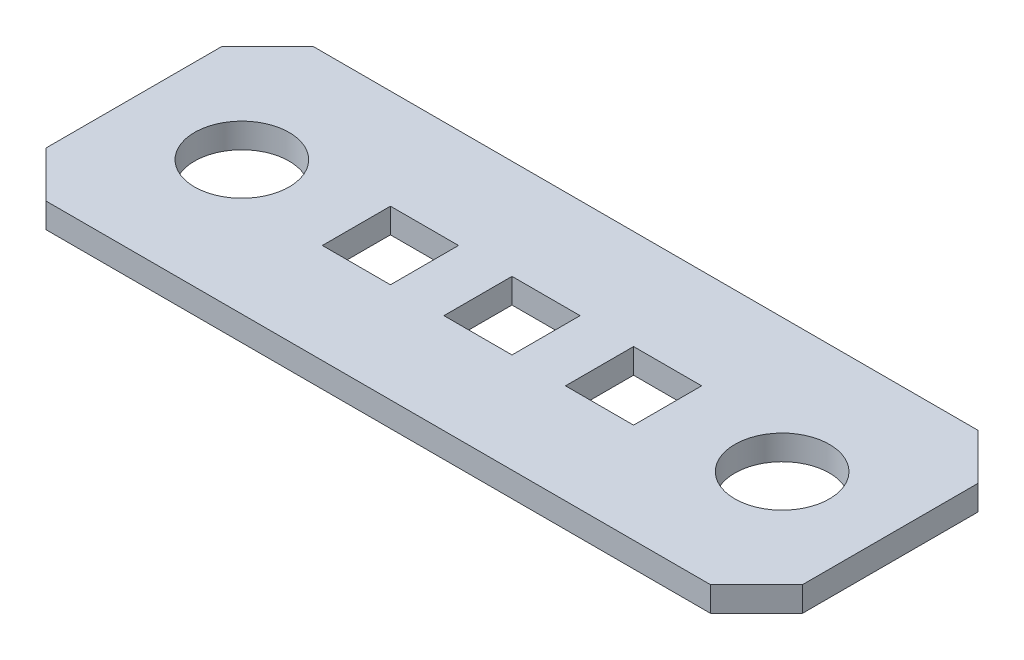
ISO-10303-21;
HEADER;
FILE_DESCRIPTION(('STEP AP214'),'2;1');
FILE_NAME('part.step','',(''),(''),'','','');
FILE_SCHEMA(('AUTOMOTIVE_DESIGN { 1 0 10303 214 1 1 1 1 }'));
ENDSEC;
DATA;
#1=APPLICATION_CONTEXT('core data for automotive mechanical design processes');
#2=APPLICATION_PROTOCOL_DEFINITION('international standard','automotive_design',2000,#1);
#3=PRODUCT_CONTEXT('',#1,'mechanical');
#4=PRODUCT('Part','Part','',(#3));
#5=PRODUCT_RELATED_PRODUCT_CATEGORY('part','',(#4));
#6=PRODUCT_DEFINITION_FORMATION('','',#4);
#7=PRODUCT_DEFINITION_CONTEXT('part definition',#1,'design');
#8=PRODUCT_DEFINITION('design','',#6,#7);
#9=PRODUCT_DEFINITION_SHAPE('','',#8);
#10=(LENGTH_UNIT() NAMED_UNIT(*) SI_UNIT(.MILLI.,.METRE.));
#11=(NAMED_UNIT(*) PLANE_ANGLE_UNIT() SI_UNIT($,.RADIAN.));
#12=(NAMED_UNIT(*) SI_UNIT($,.STERADIAN.) SOLID_ANGLE_UNIT());
#13=UNCERTAINTY_MEASURE_WITH_UNIT(LENGTH_MEASURE(1.E-05),#10,'distance_accuracy_value','');
#14=(GEOMETRIC_REPRESENTATION_CONTEXT(3) GLOBAL_UNCERTAINTY_ASSIGNED_CONTEXT((#13)) GLOBAL_UNIT_ASSIGNED_CONTEXT((#10,
#11,#12)) REPRESENTATION_CONTEXT('',''));
#15=CARTESIAN_POINT('',(0.,0.,0.));
#16=DIRECTION('',(0.,0.,1.));
#17=DIRECTION('',(1.,0.,0.));
#18=AXIS2_PLACEMENT_3D('',#15,#16,#17);
#19=CARTESIAN_POINT('',(0.,0.,0.));
#20=DIRECTION('',(0.,1.,0.));
#21=DIRECTION('',(0.,0.,1.));
#22=AXIS2_PLACEMENT_3D('',#19,#20,#21);
#23=PLANE('',#22);
#24=DIRECTION('',(1.,0.,0.));
#25=VECTOR('',#24,1.);
#26=CARTESIAN_POINT('',(21.8948,0.,-4.6863));
#27=LINE('',#26,#25);
#28=CARTESIAN_POINT('',(21.8948,0.,-4.6863));
#29=VERTEX_POINT('',#28);
#30=CARTESIAN_POINT('',(25.0952,0.,-4.6863));
#31=VERTEX_POINT('',#30);
#32=EDGE_CURVE('E458',#29,#31,#27,.T.);
#33=ORIENTED_EDGE('',*,*,#32,.T.);
#34=DIRECTION('',(0.,0.,-1.));
#35=VECTOR('',#34,1.);
#36=CARTESIAN_POINT('',(25.0952,0.,-7.8867));
#37=LINE('',#36,#35);
#38=CARTESIAN_POINT('',(25.0952,0.,-7.8867));
#39=VERTEX_POINT('',#38);
#40=EDGE_CURVE('E451',#31,#39,#37,.T.);
#41=ORIENTED_EDGE('',*,*,#40,.T.);
#42=DIRECTION('',(-1.,0.,0.));
#43=VECTOR('',#42,1.);
#44=CARTESIAN_POINT('',(21.8948,0.,-7.8867));
#45=LINE('',#44,#43);
#46=CARTESIAN_POINT('',(21.8948,0.,-7.8867));
#47=VERTEX_POINT('',#46);
#48=EDGE_CURVE('E447',#39,#47,#45,.T.);
#49=ORIENTED_EDGE('',*,*,#48,.T.);
#50=DIRECTION('',(0.,0.,1.));
#51=VECTOR('',#50,1.);
#52=CARTESIAN_POINT('',(21.8948,0.,-7.8867));
#53=LINE('',#52,#51);
#54=EDGE_CURVE('E445',#47,#29,#53,.T.);
#55=ORIENTED_EDGE('',*,*,#54,.T.);
#56=EDGE_LOOP('',(#33,#41,#49,#55));
#57=FACE_BOUND('',#56,.T.);
#58=DIRECTION('',(0.707106781186544,0.,0.707106781186551));
#59=VECTOR('',#58,1.);
#60=CARTESIAN_POINT('',(33.401,0.,-12.573));
#61=LINE('',#60,#59);
#62=CARTESIAN_POINT('',(33.401,0.,-12.573));
#63=VERTEX_POINT('',#62);
#64=CARTESIAN_POINT('',(35.56,0.,-10.414));
#65=VERTEX_POINT('',#64);
#66=EDGE_CURVE('E413',#63,#65,#61,.T.);
#67=ORIENTED_EDGE('',*,*,#66,.T.);
#68=DIRECTION('',(0.,0.,1.));
#69=VECTOR('',#68,1.);
#70=CARTESIAN_POINT('',(35.56,0.,-12.573));
#71=LINE('',#70,#69);
#72=CARTESIAN_POINT('',(35.56,0.,-2.15900000000001));
#73=VERTEX_POINT('',#72);
#74=EDGE_CURVE('E411',#65,#73,#71,.T.);
#75=ORIENTED_EDGE('',*,*,#74,.T.);
#76=DIRECTION('',(-0.707106781186548,0.,0.707106781186548));
#77=VECTOR('',#76,1.);
#78=CARTESIAN_POINT('',(35.56,0.,-2.15900000000001));
#79=LINE('',#78,#77);
#80=CARTESIAN_POINT('',(33.401,0.,0.));
#81=VERTEX_POINT('',#80);
#82=EDGE_CURVE('E441',#73,#81,#79,.T.);
#83=ORIENTED_EDGE('',*,*,#82,.T.);
#84=DIRECTION('',(-1.,0.,0.));
#85=VECTOR('',#84,1.);
#86=CARTESIAN_POINT('',(0.,0.,0.));
#87=LINE('',#86,#85);
#88=CARTESIAN_POINT('',(2.15900000000001,0.,0.));
#89=VERTEX_POINT('',#88);
#90=EDGE_CURVE('E435',#81,#89,#87,.T.);
#91=ORIENTED_EDGE('',*,*,#90,.T.);
#92=DIRECTION('',(-0.707106781186548,0.,-0.707106781186548));
#93=VECTOR('',#92,1.);
#94=CARTESIAN_POINT('',(2.15900000000001,0.,0.));
#95=LINE('',#94,#93);
#96=CARTESIAN_POINT('',(0.,0.,-2.15900000000002));
#97=VERTEX_POINT('',#96);
#98=EDGE_CURVE('E429',#89,#97,#95,.T.);
#99=ORIENTED_EDGE('',*,*,#98,.T.);
#100=DIRECTION('',(0.,0.,-1.));
#101=VECTOR('',#100,1.);
#102=CARTESIAN_POINT('',(0.,0.,-12.573));
#103=LINE('',#102,#101);
#104=CARTESIAN_POINT('',(0.,0.,-10.414));
#105=VERTEX_POINT('',#104);
#106=EDGE_CURVE('E425',#97,#105,#103,.T.);
#107=ORIENTED_EDGE('',*,*,#106,.T.);
#108=DIRECTION('',(0.707106781186549,0.,-0.707106781186546));
#109=VECTOR('',#108,1.);
#110=CARTESIAN_POINT('',(0.,0.,-10.414));
#111=LINE('',#110,#109);
#112=CARTESIAN_POINT('',(2.15899999999999,0.,-12.573));
#113=VERTEX_POINT('',#112);
#114=EDGE_CURVE('E421',#105,#113,#111,.T.);
#115=ORIENTED_EDGE('',*,*,#114,.T.);
#116=DIRECTION('',(1.,0.,0.));
#117=VECTOR('',#116,1.);
#118=CARTESIAN_POINT('',(0.,0.,-12.573));
#119=LINE('',#118,#117);
#120=EDGE_CURVE('E417',#113,#63,#119,.T.);
#121=ORIENTED_EDGE('',*,*,#120,.T.);
#122=EDGE_LOOP('',(#67,#75,#83,#91,#99,#107,#115,#121));
#123=FACE_BOUND('',#122,.T.);
#124=DIRECTION('',(0.,0.,1.));
#125=VECTOR('',#124,1.);
#126=CARTESIAN_POINT('',(10.4648,0.,-7.8867));
#127=LINE('',#126,#125);
#128=CARTESIAN_POINT('',(10.4648,0.,-7.8867));
#129=VERTEX_POINT('',#128);
#130=CARTESIAN_POINT('',(10.4648,0.,-4.6863));
#131=VERTEX_POINT('',#130);
#132=EDGE_CURVE('E394',#129,#131,#127,.T.);
#133=ORIENTED_EDGE('',*,*,#132,.T.);
#134=DIRECTION('',(1.,0.,0.));
#135=VECTOR('',#134,1.);
#136=CARTESIAN_POINT('',(10.4648,0.,-4.6863));
#137=LINE('',#136,#135);
#138=CARTESIAN_POINT('',(13.6652,0.,-4.6863));
#139=VERTEX_POINT('',#138);
#140=EDGE_CURVE('E407',#131,#139,#137,.T.);
#141=ORIENTED_EDGE('',*,*,#140,.T.);
#142=DIRECTION('',(0.,0.,-1.));
#143=VECTOR('',#142,1.);
#144=CARTESIAN_POINT('',(13.6652,0.,-7.8867));
#145=LINE('',#144,#143);
#146=CARTESIAN_POINT('',(13.6652,0.,-7.8867));
#147=VERTEX_POINT('',#146);
#148=EDGE_CURVE('E400',#139,#147,#145,.T.);
#149=ORIENTED_EDGE('',*,*,#148,.T.);
#150=DIRECTION('',(-1.,0.,0.));
#151=VECTOR('',#150,1.);
#152=CARTESIAN_POINT('',(10.4648,0.,-7.8867));
#153=LINE('',#152,#151);
#154=EDGE_CURVE('E396',#147,#129,#153,.T.);
#155=ORIENTED_EDGE('',*,*,#154,.T.);
#156=EDGE_LOOP('',(#133,#141,#149,#155));
#157=FACE_BOUND('',#156,.T.);
#158=DIRECTION('',(0.,0.,1.));
#159=VECTOR('',#158,1.);
#160=CARTESIAN_POINT('',(16.1798,0.,-7.8867));
#161=LINE('',#160,#159);
#162=CARTESIAN_POINT('',(16.1798,0.,-7.8867));
#163=VERTEX_POINT('',#162);
#164=CARTESIAN_POINT('',(16.1798,0.,-4.6863));
#165=VERTEX_POINT('',#164);
#166=EDGE_CURVE('E155',#163,#165,#161,.T.);
#167=ORIENTED_EDGE('',*,*,#166,.T.);
#168=DIRECTION('',(1.,0.,0.));
#169=VECTOR('',#168,1.);
#170=CARTESIAN_POINT('',(16.1798,0.,-4.6863));
#171=LINE('',#170,#169);
#172=CARTESIAN_POINT('',(19.3802,0.,-4.6863));
#173=VERTEX_POINT('',#172);
#174=EDGE_CURVE('E388',#165,#173,#171,.T.);
#175=ORIENTED_EDGE('',*,*,#174,.T.);
#176=DIRECTION('',(0.,0.,-1.));
#177=VECTOR('',#176,1.);
#178=CARTESIAN_POINT('',(19.3802,0.,-7.8867));
#179=LINE('',#178,#177);
#180=CARTESIAN_POINT('',(19.3802,0.,-7.8867));
#181=VERTEX_POINT('',#180);
#182=EDGE_CURVE('E150',#173,#181,#179,.T.);
#183=ORIENTED_EDGE('',*,*,#182,.T.);
#184=DIRECTION('',(-1.,0.,0.));
#185=VECTOR('',#184,1.);
#186=CARTESIAN_POINT('',(16.1798,0.,-7.8867));
#187=LINE('',#186,#185);
#188=EDGE_CURVE('E152',#181,#163,#187,.T.);
#189=ORIENTED_EDGE('',*,*,#188,.T.);
#190=EDGE_LOOP('',(#167,#175,#183,#189));
#191=FACE_BOUND('',#190,.T.);
#192=CARTESIAN_POINT('',(5.07999999999998,0.,-6.28650000000001));
#193=DIRECTION('',(0.,1.,0.));
#194=DIRECTION('',(0.,0.,1.));
#195=AXIS2_PLACEMENT_3D('',#192,#193,#194);
#196=CIRCLE('',#195,2.2225);
#197=CARTESIAN_POINT('',(5.07999999999998,0.,-4.06400000000001));
#198=VERTEX_POINT('',#197);
#199=EDGE_CURVE('E168',#198,#198,#196,.T.);
#200=ORIENTED_EDGE('',*,*,#199,.T.);
#201=EDGE_LOOP('',(#200));
#202=FACE_BOUND('',#201,.T.);
#203=CARTESIAN_POINT('',(30.48,0.,-6.28650000000001));
#204=DIRECTION('',(0.,1.,0.));
#205=DIRECTION('',(0.,0.,1.));
#206=AXIS2_PLACEMENT_3D('',#203,#204,#205);
#207=CIRCLE('',#206,2.2225);
#208=CARTESIAN_POINT('',(30.48,0.,-4.06400000000001));
#209=VERTEX_POINT('',#208);
#210=EDGE_CURVE('E18',#209,#209,#207,.T.);
#211=ORIENTED_EDGE('',*,*,#210,.T.);
#212=EDGE_LOOP('',(#211));
#213=FACE_BOUND('',#212,.T.);
#214=ADVANCED_FACE('F15',(#57,#123,#157,#191,#202,#213),#23,.F.);
#215=CARTESIAN_POINT('',(30.48,0.,-6.28650000000001));
#216=DIRECTION('',(0.,1.,0.));
#217=DIRECTION('',(0.,0.,1.));
#218=AXIS2_PLACEMENT_3D('',#215,#216,#217);
#219=CYLINDRICAL_SURFACE('',#218,2.2225);
#220=CARTESIAN_POINT('',(30.48,1.1684,-6.28650000000001));
#221=DIRECTION('',(0.,1.,0.));
#222=DIRECTION('',(0.,0.,1.));
#223=AXIS2_PLACEMENT_3D('',#220,#221,#222);
#224=CIRCLE('',#223,2.2225);
#225=CARTESIAN_POINT('',(30.48,1.1684,-4.06400000000001));
#226=VERTEX_POINT('',#225);
#227=EDGE_CURVE('E183',#226,#226,#224,.F.);
#228=ORIENTED_EDGE('',*,*,#227,.F.);
#229=EDGE_LOOP('',(#228));
#230=FACE_BOUND('',#229,.T.);
#231=ORIENTED_EDGE('',*,*,#210,.F.);
#232=EDGE_LOOP('',(#231));
#233=FACE_BOUND('',#232,.T.);
#234=ADVANCED_FACE('F191',(#230,#233),#219,.F.);
#235=CARTESIAN_POINT('',(5.07999999999998,0.,-6.28650000000001));
#236=DIRECTION('',(0.,1.,0.));
#237=DIRECTION('',(0.,0.,1.));
#238=AXIS2_PLACEMENT_3D('',#235,#236,#237);
#239=CYLINDRICAL_SURFACE('',#238,2.2225);
#240=CARTESIAN_POINT('',(5.07999999999998,1.1684,-6.28650000000001));
#241=DIRECTION('',(0.,1.,0.));
#242=DIRECTION('',(0.,0.,1.));
#243=AXIS2_PLACEMENT_3D('',#240,#241,#242);
#244=CIRCLE('',#243,2.2225);
#245=CARTESIAN_POINT('',(5.07999999999998,1.1684,-4.06400000000001));
#246=VERTEX_POINT('',#245);
#247=EDGE_CURVE('E179',#246,#246,#244,.F.);
#248=ORIENTED_EDGE('',*,*,#247,.F.);
#249=EDGE_LOOP('',(#248));
#250=FACE_BOUND('',#249,.T.);
#251=ORIENTED_EDGE('',*,*,#199,.F.);
#252=EDGE_LOOP('',(#251));
#253=FACE_BOUND('',#252,.T.);
#254=ADVANCED_FACE('F193',(#250,#253),#239,.F.);
#255=CARTESIAN_POINT('',(16.1798,0.,-7.8867));
#256=DIRECTION('',(-1.,0.,0.));
#257=DIRECTION('',(0.,0.,1.));
#258=AXIS2_PLACEMENT_3D('',#255,#256,#257);
#259=PLANE('',#258);
#260=DIRECTION('',(0.,1.,0.));
#261=VECTOR('',#260,1.);
#262=CARTESIAN_POINT('',(16.1798,0.,-4.6863));
#263=LINE('',#262,#261);
#264=CARTESIAN_POINT('',(16.1798,1.1684,-4.6863));
#265=VERTEX_POINT('',#264);
#266=EDGE_CURVE('E166',#265,#165,#263,.F.);
#267=ORIENTED_EDGE('',*,*,#266,.T.);
#268=ORIENTED_EDGE('',*,*,#166,.F.);
#269=DIRECTION('',(0.,1.,0.));
#270=VECTOR('',#269,1.);
#271=CARTESIAN_POINT('',(16.1798,0.,-7.8867));
#272=LINE('',#271,#270);
#273=CARTESIAN_POINT('',(16.1798,1.1684,-7.8867));
#274=VERTEX_POINT('',#273);
#275=EDGE_CURVE('E160',#163,#274,#272,.T.);
#276=ORIENTED_EDGE('',*,*,#275,.T.);
#277=DIRECTION('',(0.,0.,1.));
#278=VECTOR('',#277,1.);
#279=CARTESIAN_POINT('',(16.1798,1.1684,0.));
#280=LINE('',#279,#278);
#281=EDGE_CURVE('E182',#265,#274,#280,.F.);
#282=ORIENTED_EDGE('',*,*,#281,.F.);
#283=EDGE_LOOP('',(#267,#268,#276,#282));
#284=FACE_BOUND('',#283,.T.);
#285=ADVANCED_FACE('F163',(#284),#259,.F.);
#286=CARTESIAN_POINT('',(16.1798,0.,-7.8867));
#287=DIRECTION('',(0.,0.,-1.));
#288=DIRECTION('',(-1.,0.,0.));
#289=AXIS2_PLACEMENT_3D('',#286,#287,#288);
#290=PLANE('',#289);
#291=ORIENTED_EDGE('',*,*,#275,.F.);
#292=ORIENTED_EDGE('',*,*,#188,.F.);
#293=DIRECTION('',(0.,1.,0.));
#294=VECTOR('',#293,1.);
#295=CARTESIAN_POINT('',(19.3802,0.,-7.8867));
#296=LINE('',#295,#294);
#297=CARTESIAN_POINT('',(19.3802,1.1684,-7.8867));
#298=VERTEX_POINT('',#297);
#299=EDGE_CURVE('E175',#181,#298,#296,.T.);
#300=ORIENTED_EDGE('',*,*,#299,.T.);
#301=DIRECTION('',(1.,0.,0.));
#302=VECTOR('',#301,1.);
#303=CARTESIAN_POINT('',(0.,1.1684,-7.8867));
#304=LINE('',#303,#302);
#305=EDGE_CURVE('E172',#274,#298,#304,.T.);
#306=ORIENTED_EDGE('',*,*,#305,.F.);
#307=EDGE_LOOP('',(#291,#292,#300,#306));
#308=FACE_BOUND('',#307,.T.);
#309=ADVANCED_FACE('F170',(#308),#290,.F.);
#310=CARTESIAN_POINT('',(19.3802,0.,-7.8867));
#311=DIRECTION('',(1.,0.,0.));
#312=DIRECTION('',(0.,0.,-1.));
#313=AXIS2_PLACEMENT_3D('',#310,#311,#312);
#314=PLANE('',#313);
#315=ORIENTED_EDGE('',*,*,#299,.F.);
#316=ORIENTED_EDGE('',*,*,#182,.F.);
#317=DIRECTION('',(0.,1.,0.));
#318=VECTOR('',#317,1.);
#319=CARTESIAN_POINT('',(19.3802,0.,-4.6863));
#320=LINE('',#319,#318);
#321=CARTESIAN_POINT('',(19.3802,1.1684,-4.6863));
#322=VERTEX_POINT('',#321);
#323=EDGE_CURVE('E392',#173,#322,#320,.T.);
#324=ORIENTED_EDGE('',*,*,#323,.T.);
#325=DIRECTION('',(0.,0.,1.));
#326=VECTOR('',#325,1.);
#327=CARTESIAN_POINT('',(19.3802,1.1684,0.));
#328=LINE('',#327,#326);
#329=EDGE_CURVE('E387',#298,#322,#328,.T.);
#330=ORIENTED_EDGE('',*,*,#329,.F.);
#331=EDGE_LOOP('',(#315,#316,#324,#330));
#332=FACE_BOUND('',#331,.T.);
#333=ADVANCED_FACE('F279',(#332),#314,.F.);
#334=CARTESIAN_POINT('',(16.1798,0.,-4.6863));
#335=DIRECTION('',(0.,0.,1.));
#336=DIRECTION('',(1.,0.,0.));
#337=AXIS2_PLACEMENT_3D('',#334,#335,#336);
#338=PLANE('',#337);
#339=ORIENTED_EDGE('',*,*,#323,.F.);
#340=ORIENTED_EDGE('',*,*,#174,.F.);
#341=ORIENTED_EDGE('',*,*,#266,.F.);
#342=DIRECTION('',(1.,0.,0.));
#343=VECTOR('',#342,1.);
#344=CARTESIAN_POINT('',(0.,1.1684,-4.6863));
#345=LINE('',#344,#343);
#346=EDGE_CURVE('E464',#322,#265,#345,.F.);
#347=ORIENTED_EDGE('',*,*,#346,.F.);
#348=EDGE_LOOP('',(#339,#340,#341,#347));
#349=FACE_BOUND('',#348,.T.);
#350=ADVANCED_FACE('F275',(#349),#338,.F.);
#351=CARTESIAN_POINT('',(10.4648,0.,-7.8867));
#352=DIRECTION('',(-1.,0.,0.));
#353=DIRECTION('',(0.,0.,1.));
#354=AXIS2_PLACEMENT_3D('',#351,#352,#353);
#355=PLANE('',#354);
#356=DIRECTION('',(0.,1.,0.));
#357=VECTOR('',#356,1.);
#358=CARTESIAN_POINT('',(10.4648,0.,-4.6863));
#359=LINE('',#358,#357);
#360=CARTESIAN_POINT('',(10.4648,1.1684,-4.6863));
#361=VERTEX_POINT('',#360);
#362=EDGE_CURVE('E404',#361,#131,#359,.F.);
#363=ORIENTED_EDGE('',*,*,#362,.T.);
#364=ORIENTED_EDGE('',*,*,#132,.F.);
#365=DIRECTION('',(0.,1.,0.));
#366=VECTOR('',#365,1.);
#367=CARTESIAN_POINT('',(10.4648,0.,-7.8867));
#368=LINE('',#367,#366);
#369=CARTESIAN_POINT('',(10.4648,1.1684,-7.8867));
#370=VERTEX_POINT('',#369);
#371=EDGE_CURVE('E398',#129,#370,#368,.T.);
#372=ORIENTED_EDGE('',*,*,#371,.T.);
#373=DIRECTION('',(0.,0.,1.));
#374=VECTOR('',#373,1.);
#375=CARTESIAN_POINT('',(10.4648,1.1684,0.));
#376=LINE('',#375,#374);
#377=EDGE_CURVE('E467',#361,#370,#376,.F.);
#378=ORIENTED_EDGE('',*,*,#377,.F.);
#379=EDGE_LOOP('',(#363,#364,#372,#378));
#380=FACE_BOUND('',#379,.T.);
#381=ADVANCED_FACE('F271',(#380),#355,.F.);
#382=CARTESIAN_POINT('',(10.4648,0.,-7.8867));
#383=DIRECTION('',(0.,0.,-1.));
#384=DIRECTION('',(-1.,0.,0.));
#385=AXIS2_PLACEMENT_3D('',#382,#383,#384);
#386=PLANE('',#385);
#387=ORIENTED_EDGE('',*,*,#371,.F.);
#388=ORIENTED_EDGE('',*,*,#154,.F.);
#389=DIRECTION('',(0.,1.,0.));
#390=VECTOR('',#389,1.);
#391=CARTESIAN_POINT('',(13.6652,0.,-7.8867));
#392=LINE('',#391,#390);
#393=CARTESIAN_POINT('',(13.6652,1.1684,-7.8867));
#394=VERTEX_POINT('',#393);
#395=EDGE_CURVE('E402',#147,#394,#392,.T.);
#396=ORIENTED_EDGE('',*,*,#395,.T.);
#397=DIRECTION('',(1.,0.,0.));
#398=VECTOR('',#397,1.);
#399=CARTESIAN_POINT('',(0.,1.1684,-7.8867));
#400=LINE('',#399,#398);
#401=EDGE_CURVE('E470',#370,#394,#400,.T.);
#402=ORIENTED_EDGE('',*,*,#401,.F.);
#403=EDGE_LOOP('',(#387,#388,#396,#402));
#404=FACE_BOUND('',#403,.T.);
#405=ADVANCED_FACE('F267',(#404),#386,.F.);
#406=CARTESIAN_POINT('',(13.6652,0.,-7.8867));
#407=DIRECTION('',(1.,0.,0.));
#408=DIRECTION('',(0.,0.,-1.));
#409=AXIS2_PLACEMENT_3D('',#406,#407,#408);
#410=PLANE('',#409);
#411=ORIENTED_EDGE('',*,*,#395,.F.);
#412=ORIENTED_EDGE('',*,*,#148,.F.);
#413=DIRECTION('',(0.,1.,0.));
#414=VECTOR('',#413,1.);
#415=CARTESIAN_POINT('',(13.6652,0.,-4.6863));
#416=LINE('',#415,#414);
#417=CARTESIAN_POINT('',(13.6652,1.1684,-4.6863));
#418=VERTEX_POINT('',#417);
#419=EDGE_CURVE('E409',#139,#418,#416,.T.);
#420=ORIENTED_EDGE('',*,*,#419,.T.);
#421=DIRECTION('',(0.,0.,1.));
#422=VECTOR('',#421,1.);
#423=CARTESIAN_POINT('',(13.6652,1.1684,0.));
#424=LINE('',#423,#422);
#425=EDGE_CURVE('E473',#394,#418,#424,.T.);
#426=ORIENTED_EDGE('',*,*,#425,.F.);
#427=EDGE_LOOP('',(#411,#412,#420,#426));
#428=FACE_BOUND('',#427,.T.);
#429=ADVANCED_FACE('F263',(#428),#410,.F.);
#430=CARTESIAN_POINT('',(10.4648,0.,-4.6863));
#431=DIRECTION('',(0.,0.,1.));
#432=DIRECTION('',(1.,0.,0.));
#433=AXIS2_PLACEMENT_3D('',#430,#431,#432);
#434=PLANE('',#433);
#435=ORIENTED_EDGE('',*,*,#419,.F.);
#436=ORIENTED_EDGE('',*,*,#140,.F.);
#437=ORIENTED_EDGE('',*,*,#362,.F.);
#438=DIRECTION('',(1.,0.,0.));
#439=VECTOR('',#438,1.);
#440=CARTESIAN_POINT('',(0.,1.1684,-4.6863));
#441=LINE('',#440,#439);
#442=EDGE_CURVE('E476',#418,#361,#441,.F.);
#443=ORIENTED_EDGE('',*,*,#442,.F.);
#444=EDGE_LOOP('',(#435,#436,#437,#443));
#445=FACE_BOUND('',#444,.T.);
#446=ADVANCED_FACE('F259',(#445),#434,.F.);
#447=CARTESIAN_POINT('',(35.56,1.1684,-12.573));
#448=DIRECTION('',(-1.,0.,0.));
#449=DIRECTION('',(0.,0.,1.));
#450=AXIS2_PLACEMENT_3D('',#447,#448,#449);
#451=PLANE('',#450);
#452=DIRECTION('',(0.,1.,0.));
#453=VECTOR('',#452,1.);
#454=CARTESIAN_POINT('',(35.56,1.1684,-10.414));
#455=LINE('',#454,#453);
#456=CARTESIAN_POINT('',(35.56,1.1684,-10.414));
#457=VERTEX_POINT('',#456);
#458=EDGE_CURVE('E415',#65,#457,#455,.T.);
#459=ORIENTED_EDGE('',*,*,#458,.T.);
#460=DIRECTION('',(0.,0.,1.));
#461=VECTOR('',#460,1.);
#462=CARTESIAN_POINT('',(35.56,1.1684,0.));
#463=LINE('',#462,#461);
#464=CARTESIAN_POINT('',(35.56,1.1684,-2.15900000000001));
#465=VERTEX_POINT('',#464);
#466=EDGE_CURVE('E479',#465,#457,#463,.F.);
#467=ORIENTED_EDGE('',*,*,#466,.F.);
#468=DIRECTION('',(0.,1.,0.));
#469=VECTOR('',#468,1.);
#470=CARTESIAN_POINT('',(35.56,1.1684,-2.15900000000002));
#471=LINE('',#470,#469);
#472=EDGE_CURVE('E438',#465,#73,#471,.F.);
#473=ORIENTED_EDGE('',*,*,#472,.T.);
#474=ORIENTED_EDGE('',*,*,#74,.F.);
#475=EDGE_LOOP('',(#459,#467,#473,#474));
#476=FACE_BOUND('',#475,.T.);
#477=ADVANCED_FACE('F255',(#476),#451,.F.);
#478=CARTESIAN_POINT('',(33.401,1.1684,-12.573));
#479=DIRECTION('',(-0.707106781186551,0.,0.707106781186544));
#480=DIRECTION('',(0.707106781186544,0.,0.707106781186551));
#481=AXIS2_PLACEMENT_3D('',#478,#479,#480);
#482=PLANE('',#481);
#483=ORIENTED_EDGE('',*,*,#458,.F.);
#484=ORIENTED_EDGE('',*,*,#66,.F.);
#485=DIRECTION('',(0.,1.,0.));
#486=VECTOR('',#485,1.);
#487=CARTESIAN_POINT('',(33.401,1.1684,-12.573));
#488=LINE('',#487,#486);
#489=CARTESIAN_POINT('',(33.401,1.1684,-12.573));
#490=VERTEX_POINT('',#489);
#491=EDGE_CURVE('E419',#63,#490,#488,.T.);
#492=ORIENTED_EDGE('',*,*,#491,.T.);
#493=DIRECTION('',(-0.707106781186544,0.,-0.707106781186551));
#494=VECTOR('',#493,1.);
#495=CARTESIAN_POINT('',(35.56,1.1684,-10.414));
#496=LINE('',#495,#494);
#497=EDGE_CURVE('E482',#457,#490,#496,.T.);
#498=ORIENTED_EDGE('',*,*,#497,.F.);
#499=EDGE_LOOP('',(#483,#484,#492,#498));
#500=FACE_BOUND('',#499,.T.);
#501=ADVANCED_FACE('F251',(#500),#482,.F.);
#502=CARTESIAN_POINT('',(0.,1.1684,-12.573));
#503=DIRECTION('',(0.,0.,1.));
#504=DIRECTION('',(1.,0.,0.));
#505=AXIS2_PLACEMENT_3D('',#502,#503,#504);
#506=PLANE('',#505);
#507=ORIENTED_EDGE('',*,*,#491,.F.);
#508=ORIENTED_EDGE('',*,*,#120,.F.);
#509=DIRECTION('',(0.,1.,0.));
#510=VECTOR('',#509,1.);
#511=CARTESIAN_POINT('',(2.15899999999999,1.1684,-12.573));
#512=LINE('',#511,#510);
#513=CARTESIAN_POINT('',(2.15899999999999,1.1684,-12.573));
#514=VERTEX_POINT('',#513);
#515=EDGE_CURVE('E423',#113,#514,#512,.T.);
#516=ORIENTED_EDGE('',*,*,#515,.T.);
#517=DIRECTION('',(1.,0.,0.));
#518=VECTOR('',#517,1.);
#519=CARTESIAN_POINT('',(0.,1.1684,-12.573));
#520=LINE('',#519,#518);
#521=EDGE_CURVE('E485',#490,#514,#520,.F.);
#522=ORIENTED_EDGE('',*,*,#521,.F.);
#523=EDGE_LOOP('',(#507,#508,#516,#522));
#524=FACE_BOUND('',#523,.T.);
#525=ADVANCED_FACE('F247',(#524),#506,.F.);
#526=CARTESIAN_POINT('',(0.,1.1684,-10.414));
#527=DIRECTION('',(0.707106781186546,0.,0.707106781186549));
#528=DIRECTION('',(0.707106781186549,0.,-0.707106781186546));
#529=AXIS2_PLACEMENT_3D('',#526,#527,#528);
#530=PLANE('',#529);
#531=ORIENTED_EDGE('',*,*,#515,.F.);
#532=ORIENTED_EDGE('',*,*,#114,.F.);
#533=DIRECTION('',(0.,1.,0.));
#534=VECTOR('',#533,1.);
#535=CARTESIAN_POINT('',(0.,1.1684,-10.414));
#536=LINE('',#535,#534);
#537=CARTESIAN_POINT('',(0.,1.1684,-10.414));
#538=VERTEX_POINT('',#537);
#539=EDGE_CURVE('E427',#105,#538,#536,.T.);
#540=ORIENTED_EDGE('',*,*,#539,.T.);
#541=DIRECTION('',(-0.707106781186549,0.,0.707106781186546));
#542=VECTOR('',#541,1.);
#543=CARTESIAN_POINT('',(2.15899999999999,1.1684,-12.573));
#544=LINE('',#543,#542);
#545=EDGE_CURVE('E488',#514,#538,#544,.T.);
#546=ORIENTED_EDGE('',*,*,#545,.F.);
#547=EDGE_LOOP('',(#531,#532,#540,#546));
#548=FACE_BOUND('',#547,.T.);
#549=ADVANCED_FACE('F243',(#548),#530,.F.);
#550=CARTESIAN_POINT('',(0.,1.1684,-12.573));
#551=DIRECTION('',(1.,0.,0.));
#552=DIRECTION('',(0.,0.,-1.));
#553=AXIS2_PLACEMENT_3D('',#550,#551,#552);
#554=PLANE('',#553);
#555=ORIENTED_EDGE('',*,*,#539,.F.);
#556=ORIENTED_EDGE('',*,*,#106,.F.);
#557=DIRECTION('',(0.,1.,0.));
#558=VECTOR('',#557,1.);
#559=CARTESIAN_POINT('',(0.,1.1684,-2.15900000000001));
#560=LINE('',#559,#558);
#561=CARTESIAN_POINT('',(0.,1.1684,-2.15900000000002));
#562=VERTEX_POINT('',#561);
#563=EDGE_CURVE('E431',#97,#562,#560,.T.);
#564=ORIENTED_EDGE('',*,*,#563,.T.);
#565=DIRECTION('',(0.,0.,1.));
#566=VECTOR('',#565,1.);
#567=CARTESIAN_POINT('',(0.,1.1684,0.));
#568=LINE('',#567,#566);
#569=EDGE_CURVE('E491',#538,#562,#568,.T.);
#570=ORIENTED_EDGE('',*,*,#569,.F.);
#571=EDGE_LOOP('',(#555,#556,#564,#570));
#572=FACE_BOUND('',#571,.T.);
#573=ADVANCED_FACE('F239',(#572),#554,.F.);
#574=CARTESIAN_POINT('',(2.15900000000001,1.1684,0.));
#575=DIRECTION('',(0.707106781186548,0.,-0.707106781186548));
#576=DIRECTION('',(-0.707106781186548,0.,-0.707106781186548));
#577=AXIS2_PLACEMENT_3D('',#574,#575,#576);
#578=PLANE('',#577);
#579=ORIENTED_EDGE('',*,*,#563,.F.);
#580=ORIENTED_EDGE('',*,*,#98,.F.);
#581=DIRECTION('',(0.,1.,0.));
#582=VECTOR('',#581,1.);
#583=CARTESIAN_POINT('',(2.15900000000001,1.1684,0.));
#584=LINE('',#583,#582);
#585=CARTESIAN_POINT('',(2.15900000000001,1.1684,0.));
#586=VERTEX_POINT('',#585);
#587=EDGE_CURVE('E433',#89,#586,#584,.T.);
#588=ORIENTED_EDGE('',*,*,#587,.T.);
#589=DIRECTION('',(0.707106781186547,0.,0.707106781186548));
#590=VECTOR('',#589,1.);
#591=CARTESIAN_POINT('',(0.,1.1684,-2.15900000000001));
#592=LINE('',#591,#590);
#593=EDGE_CURVE('E494',#562,#586,#592,.T.);
#594=ORIENTED_EDGE('',*,*,#593,.F.);
#595=EDGE_LOOP('',(#579,#580,#588,#594));
#596=FACE_BOUND('',#595,.T.);
#597=ADVANCED_FACE('F235',(#596),#578,.F.);
#598=CARTESIAN_POINT('',(0.,1.1684,0.));
#599=DIRECTION('',(0.,0.,-1.));
#600=DIRECTION('',(-1.,0.,0.));
#601=AXIS2_PLACEMENT_3D('',#598,#599,#600);
#602=PLANE('',#601);
#603=DIRECTION('',(0.,1.,0.));
#604=VECTOR('',#603,1.);
#605=CARTESIAN_POINT('',(33.401,1.1684,0.));
#606=LINE('',#605,#604);
#607=CARTESIAN_POINT('',(33.4009999999999,1.1684,0.));
#608=VERTEX_POINT('',#607);
#609=EDGE_CURVE('E443',#81,#608,#606,.T.);
#610=ORIENTED_EDGE('',*,*,#609,.T.);
#611=DIRECTION('',(1.,0.,0.));
#612=VECTOR('',#611,1.);
#613=CARTESIAN_POINT('',(0.,1.1684,0.));
#614=LINE('',#613,#612);
#615=EDGE_CURVE('E497',#586,#608,#614,.T.);
#616=ORIENTED_EDGE('',*,*,#615,.F.);
#617=ORIENTED_EDGE('',*,*,#587,.F.);
#618=ORIENTED_EDGE('',*,*,#90,.F.);
#619=EDGE_LOOP('',(#610,#616,#617,#618));
#620=FACE_BOUND('',#619,.T.);
#621=ADVANCED_FACE('F231',(#620),#602,.F.);
#622=CARTESIAN_POINT('',(35.56,1.1684,-2.15900000000001));
#623=DIRECTION('',(-0.707106781186548,0.,-0.707106781186548));
#624=DIRECTION('',(-0.707106781186548,0.,0.707106781186548));
#625=AXIS2_PLACEMENT_3D('',#622,#623,#624);
#626=PLANE('',#625);
#627=ORIENTED_EDGE('',*,*,#609,.F.);
#628=ORIENTED_EDGE('',*,*,#82,.F.);
#629=ORIENTED_EDGE('',*,*,#472,.F.);
#630=DIRECTION('',(0.707106781186548,0.,-0.707106781186547));
#631=VECTOR('',#630,1.);
#632=CARTESIAN_POINT('',(33.4009999999999,1.1684,0.));
#633=LINE('',#632,#631);
#634=EDGE_CURVE('E500',#608,#465,#633,.T.);
#635=ORIENTED_EDGE('',*,*,#634,.F.);
#636=EDGE_LOOP('',(#627,#628,#629,#635));
#637=FACE_BOUND('',#636,.T.);
#638=ADVANCED_FACE('F227',(#637),#626,.F.);
#639=CARTESIAN_POINT('',(21.8948,0.,-7.8867));
#640=DIRECTION('',(-1.,0.,0.));
#641=DIRECTION('',(0.,0.,1.));
#642=AXIS2_PLACEMENT_3D('',#639,#640,#641);
#643=PLANE('',#642);
#644=DIRECTION('',(0.,1.,0.));
#645=VECTOR('',#644,1.);
#646=CARTESIAN_POINT('',(21.8948,0.,-4.6863));
#647=LINE('',#646,#645);
#648=CARTESIAN_POINT('',(21.8948,1.1684,-4.6863));
#649=VERTEX_POINT('',#648);
#650=EDGE_CURVE('E455',#649,#29,#647,.F.);
#651=ORIENTED_EDGE('',*,*,#650,.T.);
#652=ORIENTED_EDGE('',*,*,#54,.F.);
#653=DIRECTION('',(0.,1.,0.));
#654=VECTOR('',#653,1.);
#655=CARTESIAN_POINT('',(21.8948,0.,-7.8867));
#656=LINE('',#655,#654);
#657=CARTESIAN_POINT('',(21.8948,1.1684,-7.8867));
#658=VERTEX_POINT('',#657);
#659=EDGE_CURVE('E449',#47,#658,#656,.T.);
#660=ORIENTED_EDGE('',*,*,#659,.T.);
#661=DIRECTION('',(0.,0.,1.));
#662=VECTOR('',#661,1.);
#663=CARTESIAN_POINT('',(21.8948,1.1684,0.));
#664=LINE('',#663,#662);
#665=EDGE_CURVE('E503',#649,#658,#664,.F.);
#666=ORIENTED_EDGE('',*,*,#665,.F.);
#667=EDGE_LOOP('',(#651,#652,#660,#666));
#668=FACE_BOUND('',#667,.T.);
#669=ADVANCED_FACE('F223',(#668),#643,.F.);
#670=CARTESIAN_POINT('',(21.8948,0.,-7.8867));
#671=DIRECTION('',(0.,0.,-1.));
#672=DIRECTION('',(-1.,0.,0.));
#673=AXIS2_PLACEMENT_3D('',#670,#671,#672);
#674=PLANE('',#673);
#675=ORIENTED_EDGE('',*,*,#659,.F.);
#676=ORIENTED_EDGE('',*,*,#48,.F.);
#677=DIRECTION('',(0.,1.,0.));
#678=VECTOR('',#677,1.);
#679=CARTESIAN_POINT('',(25.0952,0.,-7.8867));
#680=LINE('',#679,#678);
#681=CARTESIAN_POINT('',(25.0952,1.1684,-7.8867));
#682=VERTEX_POINT('',#681);
#683=EDGE_CURVE('E453',#39,#682,#680,.T.);
#684=ORIENTED_EDGE('',*,*,#683,.T.);
#685=DIRECTION('',(1.,0.,0.));
#686=VECTOR('',#685,1.);
#687=CARTESIAN_POINT('',(0.,1.1684,-7.8867));
#688=LINE('',#687,#686);
#689=EDGE_CURVE('E506',#658,#682,#688,.T.);
#690=ORIENTED_EDGE('',*,*,#689,.F.);
#691=EDGE_LOOP('',(#675,#676,#684,#690));
#692=FACE_BOUND('',#691,.T.);
#693=ADVANCED_FACE('F220',(#692),#674,.F.);
#694=CARTESIAN_POINT('',(25.0952,0.,-7.8867));
#695=DIRECTION('',(1.,0.,0.));
#696=DIRECTION('',(0.,0.,-1.));
#697=AXIS2_PLACEMENT_3D('',#694,#695,#696);
#698=PLANE('',#697);
#699=ORIENTED_EDGE('',*,*,#683,.F.);
#700=ORIENTED_EDGE('',*,*,#40,.F.);
#701=DIRECTION('',(0.,1.,0.));
#702=VECTOR('',#701,1.);
#703=CARTESIAN_POINT('',(25.0952,0.,-4.6863));
#704=LINE('',#703,#702);
#705=CARTESIAN_POINT('',(25.0952,1.1684,-4.6863));
#706=VERTEX_POINT('',#705);
#707=EDGE_CURVE('E33',#31,#706,#704,.T.);
#708=ORIENTED_EDGE('',*,*,#707,.T.);
#709=DIRECTION('',(0.,0.,1.));
#710=VECTOR('',#709,1.);
#711=CARTESIAN_POINT('',(25.0952,1.1684,0.));
#712=LINE('',#711,#710);
#713=EDGE_CURVE('E24',#682,#706,#712,.T.);
#714=ORIENTED_EDGE('',*,*,#713,.F.);
#715=EDGE_LOOP('',(#699,#700,#708,#714));
#716=FACE_BOUND('',#715,.T.);
#717=ADVANCED_FACE('F212',(#716),#698,.F.);
#718=CARTESIAN_POINT('',(21.8948,0.,-4.6863));
#719=DIRECTION('',(0.,0.,1.));
#720=DIRECTION('',(1.,0.,0.));
#721=AXIS2_PLACEMENT_3D('',#718,#719,#720);
#722=PLANE('',#721);
#723=ORIENTED_EDGE('',*,*,#707,.F.);
#724=ORIENTED_EDGE('',*,*,#32,.F.);
#725=ORIENTED_EDGE('',*,*,#650,.F.);
#726=DIRECTION('',(1.,0.,0.));
#727=VECTOR('',#726,1.);
#728=CARTESIAN_POINT('',(0.,1.1684,-4.6863));
#729=LINE('',#728,#727);
#730=EDGE_CURVE('E9',#706,#649,#729,.F.);
#731=ORIENTED_EDGE('',*,*,#730,.F.);
#732=EDGE_LOOP('',(#723,#724,#725,#731));
#733=FACE_BOUND('',#732,.T.);
#734=ADVANCED_FACE('F206',(#733),#722,.F.);
#735=CARTESIAN_POINT('',(0.,1.1684,0.));
#736=DIRECTION('',(0.,1.,0.));
#737=DIRECTION('',(0.,0.,1.));
#738=AXIS2_PLACEMENT_3D('',#735,#736,#737);
#739=PLANE('',#738);
#740=ORIENTED_EDGE('',*,*,#713,.T.);
#741=ORIENTED_EDGE('',*,*,#730,.T.);
#742=ORIENTED_EDGE('',*,*,#665,.T.);
#743=ORIENTED_EDGE('',*,*,#689,.T.);
#744=EDGE_LOOP('',(#740,#741,#742,#743));
#745=FACE_BOUND('',#744,.T.);
#746=ORIENTED_EDGE('',*,*,#615,.T.);
#747=ORIENTED_EDGE('',*,*,#634,.T.);
#748=ORIENTED_EDGE('',*,*,#466,.T.);
#749=ORIENTED_EDGE('',*,*,#497,.T.);
#750=ORIENTED_EDGE('',*,*,#521,.T.);
#751=ORIENTED_EDGE('',*,*,#545,.T.);
#752=ORIENTED_EDGE('',*,*,#569,.T.);
#753=ORIENTED_EDGE('',*,*,#593,.T.);
#754=EDGE_LOOP('',(#746,#747,#748,#749,#750,#751,#752,#753));
#755=FACE_BOUND('',#754,.T.);
#756=ORIENTED_EDGE('',*,*,#425,.T.);
#757=ORIENTED_EDGE('',*,*,#442,.T.);
#758=ORIENTED_EDGE('',*,*,#377,.T.);
#759=ORIENTED_EDGE('',*,*,#401,.T.);
#760=EDGE_LOOP('',(#756,#757,#758,#759));
#761=FACE_BOUND('',#760,.T.);
#762=ORIENTED_EDGE('',*,*,#329,.T.);
#763=ORIENTED_EDGE('',*,*,#346,.T.);
#764=ORIENTED_EDGE('',*,*,#281,.T.);
#765=ORIENTED_EDGE('',*,*,#305,.T.);
#766=EDGE_LOOP('',(#762,#763,#764,#765));
#767=FACE_BOUND('',#766,.T.);
#768=ORIENTED_EDGE('',*,*,#247,.T.);
#769=EDGE_LOOP('',(#768));
#770=FACE_BOUND('',#769,.T.);
#771=ORIENTED_EDGE('',*,*,#227,.T.);
#772=EDGE_LOOP('',(#771));
#773=FACE_BOUND('',#772,.T.);
#774=ADVANCED_FACE('F204',(#745,#755,#761,#767,#770,#773),#739,.T.);
#775=CLOSED_SHELL('',(#214,#234,#254,#285,#309,#333,#350,#381,#405,#429,#446,#477,#501,#525,
#549,#573,#597,#621,#638,#669,#693,#717,#734,#774));
#776=MANIFOLD_SOLID_BREP('B1',#775);
#777=ADVANCED_BREP_SHAPE_REPRESENTATION('',(#18,#776),#14);
#778=SHAPE_DEFINITION_REPRESENTATION(#9,#777);
ENDSEC;
END-ISO-10303-21;
